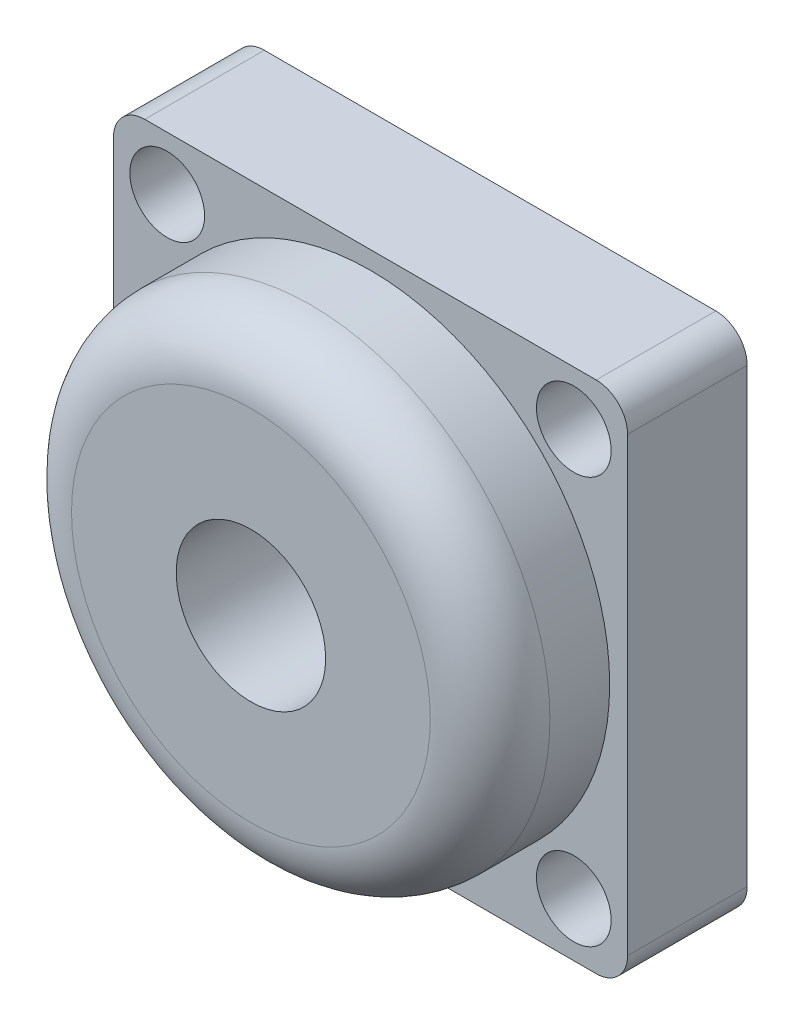
ISO-10303-21;
HEADER;
FILE_DESCRIPTION(('STEP AP214'),'2;1');
FILE_NAME('part.step','',(''),(''),'','','');
FILE_SCHEMA(('AUTOMOTIVE_DESIGN { 1 0 10303 214 1 1 1 1 }'));
ENDSEC;
DATA;
#1=APPLICATION_CONTEXT('core data for automotive mechanical design processes');
#2=APPLICATION_PROTOCOL_DEFINITION('international standard','automotive_design',2000,#1);
#3=PRODUCT_CONTEXT('',#1,'mechanical');
#4=PRODUCT('Part','Part','',(#3));
#5=PRODUCT_RELATED_PRODUCT_CATEGORY('part','',(#4));
#6=PRODUCT_DEFINITION_FORMATION('','',#4);
#7=PRODUCT_DEFINITION_CONTEXT('part definition',#1,'design');
#8=PRODUCT_DEFINITION('design','',#6,#7);
#9=PRODUCT_DEFINITION_SHAPE('','',#8);
#10=(LENGTH_UNIT() NAMED_UNIT(*) SI_UNIT(.MILLI.,.METRE.));
#11=(NAMED_UNIT(*) PLANE_ANGLE_UNIT() SI_UNIT($,.RADIAN.));
#12=(NAMED_UNIT(*) SI_UNIT($,.STERADIAN.) SOLID_ANGLE_UNIT());
#13=UNCERTAINTY_MEASURE_WITH_UNIT(LENGTH_MEASURE(1.E-05),#10,'distance_accuracy_value','');
#14=(GEOMETRIC_REPRESENTATION_CONTEXT(3) GLOBAL_UNCERTAINTY_ASSIGNED_CONTEXT((#13)) GLOBAL_UNIT_ASSIGNED_CONTEXT((#10,
#11,#12)) REPRESENTATION_CONTEXT('',''));
#15=CARTESIAN_POINT('',(0.,0.,0.));
#16=DIRECTION('',(0.,0.,1.));
#17=DIRECTION('',(1.,0.,0.));
#18=AXIS2_PLACEMENT_3D('',#15,#16,#17);
#19=CARTESIAN_POINT('',(37.75,37.75,20.));
#20=DIRECTION('',(0.,0.,-1.));
#21=DIRECTION('',(-1.,0.,0.));
#22=AXIS2_PLACEMENT_3D('',#19,#20,#21);
#23=CYLINDRICAL_SURFACE('',#22,5.24999999999999);
#24=CARTESIAN_POINT('',(37.75,37.75,0.));
#25=DIRECTION('',(0.,0.,1.));
#26=DIRECTION('',(1.,0.,0.));
#27=AXIS2_PLACEMENT_3D('',#24,#25,#26);
#28=CIRCLE('',#27,5.24999999999999);
#29=CARTESIAN_POINT('',(43.,37.75,0.));
#30=VERTEX_POINT('',#29);
#31=CARTESIAN_POINT('',(37.75,43.,0.));
#32=VERTEX_POINT('',#31);
#33=EDGE_CURVE('E135',#30,#32,#28,.T.);
#34=ORIENTED_EDGE('',*,*,#33,.T.);
#35=DIRECTION('',(0.,0.,-1.));
#36=VECTOR('',#35,1.);
#37=CARTESIAN_POINT('',(37.75,43.,20.));
#38=LINE('',#37,#36);
#39=CARTESIAN_POINT('',(37.75,43.,20.));
#40=VERTEX_POINT('',#39);
#41=EDGE_CURVE('E163',#40,#32,#38,.T.);
#42=ORIENTED_EDGE('',*,*,#41,.F.);
#43=CARTESIAN_POINT('',(37.75,37.75,20.));
#44=DIRECTION('',(0.,0.,1.));
#45=DIRECTION('',(1.,0.,0.));
#46=AXIS2_PLACEMENT_3D('',#43,#44,#45);
#47=CIRCLE('',#46,5.24999999999999);
#48=CARTESIAN_POINT('',(43.,37.75,20.));
#49=VERTEX_POINT('',#48);
#50=EDGE_CURVE('E150',#49,#40,#47,.T.);
#51=ORIENTED_EDGE('',*,*,#50,.F.);
#52=DIRECTION('',(0.,0.,-1.));
#53=VECTOR('',#52,1.);
#54=CARTESIAN_POINT('',(43.,37.75,20.));
#55=LINE('',#54,#53);
#56=EDGE_CURVE('E131',#49,#30,#55,.T.);
#57=ORIENTED_EDGE('',*,*,#56,.T.);
#58=EDGE_LOOP('',(#34,#42,#51,#57));
#59=FACE_BOUND('',#58,.T.);
#60=ADVANCED_FACE('F37',(#59),#23,.T.);
#61=CARTESIAN_POINT('',(37.75,43.,20.));
#62=DIRECTION('',(0.,-1.,0.));
#63=DIRECTION('',(1.,0.,0.));
#64=AXIS2_PLACEMENT_3D('',#61,#62,#63);
#65=PLANE('',#64);
#66=DIRECTION('',(-1.,0.,0.));
#67=VECTOR('',#66,1.);
#68=CARTESIAN_POINT('',(37.75,43.,0.));
#69=LINE('',#68,#67);
#70=CARTESIAN_POINT('',(-37.75,43.,0.));
#71=VERTEX_POINT('',#70);
#72=EDGE_CURVE('E138',#32,#71,#69,.T.);
#73=ORIENTED_EDGE('',*,*,#72,.T.);
#74=DIRECTION('',(0.,0.,-1.));
#75=VECTOR('',#74,1.);
#76=CARTESIAN_POINT('',(-37.75,43.,20.));
#77=LINE('',#76,#75);
#78=CARTESIAN_POINT('',(-37.75,43.,20.));
#79=VERTEX_POINT('',#78);
#80=EDGE_CURVE('E160',#79,#71,#77,.T.);
#81=ORIENTED_EDGE('',*,*,#80,.F.);
#82=DIRECTION('',(-1.,0.,0.));
#83=VECTOR('',#82,1.);
#84=CARTESIAN_POINT('',(37.75,43.,20.));
#85=LINE('',#84,#83);
#86=EDGE_CURVE('E98',#40,#79,#85,.T.);
#87=ORIENTED_EDGE('',*,*,#86,.F.);
#88=ORIENTED_EDGE('',*,*,#41,.T.);
#89=EDGE_LOOP('',(#73,#81,#87,#88));
#90=FACE_BOUND('',#89,.T.);
#91=ADVANCED_FACE('F181',(#90),#65,.F.);
#92=CARTESIAN_POINT('',(-37.75,37.75,20.));
#93=DIRECTION('',(0.,0.,-1.));
#94=DIRECTION('',(-1.,0.,0.));
#95=AXIS2_PLACEMENT_3D('',#92,#93,#94);
#96=CYLINDRICAL_SURFACE('',#95,5.24999999999999);
#97=CARTESIAN_POINT('',(-37.75,37.75,0.));
#98=DIRECTION('',(0.,0.,1.));
#99=DIRECTION('',(1.,0.,0.));
#100=AXIS2_PLACEMENT_3D('',#97,#98,#99);
#101=CIRCLE('',#100,5.24999999999999);
#102=CARTESIAN_POINT('',(-43.,37.75,0.));
#103=VERTEX_POINT('',#102);
#104=EDGE_CURVE('E141',#71,#103,#101,.T.);
#105=ORIENTED_EDGE('',*,*,#104,.T.);
#106=DIRECTION('',(0.,0.,-1.));
#107=VECTOR('',#106,1.);
#108=CARTESIAN_POINT('',(-43.,37.75,20.));
#109=LINE('',#108,#107);
#110=CARTESIAN_POINT('',(-43.,37.75,20.));
#111=VERTEX_POINT('',#110);
#112=EDGE_CURVE('E157',#111,#103,#109,.T.);
#113=ORIENTED_EDGE('',*,*,#112,.F.);
#114=CARTESIAN_POINT('',(-37.75,37.75,20.));
#115=DIRECTION('',(0.,0.,1.));
#116=DIRECTION('',(1.,0.,0.));
#117=AXIS2_PLACEMENT_3D('',#114,#115,#116);
#118=CIRCLE('',#117,5.24999999999999);
#119=EDGE_CURVE('E274',#79,#111,#118,.T.);
#120=ORIENTED_EDGE('',*,*,#119,.F.);
#121=ORIENTED_EDGE('',*,*,#80,.T.);
#122=EDGE_LOOP('',(#105,#113,#120,#121));
#123=FACE_BOUND('',#122,.T.);
#124=ADVANCED_FACE('F186',(#123),#96,.T.);
#125=CARTESIAN_POINT('',(-43.,-37.75,20.));
#126=DIRECTION('',(1.,0.,0.));
#127=DIRECTION('',(0.,0.,-1.));
#128=AXIS2_PLACEMENT_3D('',#125,#126,#127);
#129=PLANE('',#128);
#130=DIRECTION('',(0.,-1.,0.));
#131=VECTOR('',#130,1.);
#132=CARTESIAN_POINT('',(-43.,-37.75,0.));
#133=LINE('',#132,#131);
#134=CARTESIAN_POINT('',(-43.,-37.75,0.));
#135=VERTEX_POINT('',#134);
#136=EDGE_CURVE('E143',#103,#135,#133,.T.);
#137=ORIENTED_EDGE('',*,*,#136,.T.);
#138=DIRECTION('',(0.,0.,-1.));
#139=VECTOR('',#138,1.);
#140=CARTESIAN_POINT('',(-43.,-37.75,20.));
#141=LINE('',#140,#139);
#142=CARTESIAN_POINT('',(-43.,-37.75,20.));
#143=VERTEX_POINT('',#142);
#144=EDGE_CURVE('E154',#143,#135,#141,.T.);
#145=ORIENTED_EDGE('',*,*,#144,.F.);
#146=DIRECTION('',(0.,-1.,0.));
#147=VECTOR('',#146,1.);
#148=CARTESIAN_POINT('',(-43.,-37.75,20.));
#149=LINE('',#148,#147);
#150=EDGE_CURVE('E276',#111,#143,#149,.T.);
#151=ORIENTED_EDGE('',*,*,#150,.F.);
#152=ORIENTED_EDGE('',*,*,#112,.T.);
#153=EDGE_LOOP('',(#137,#145,#151,#152));
#154=FACE_BOUND('',#153,.T.);
#155=ADVANCED_FACE('F191',(#154),#129,.F.);
#156=CARTESIAN_POINT('',(-37.75,-37.75,20.));
#157=DIRECTION('',(0.,0.,-1.));
#158=DIRECTION('',(-1.,0.,0.));
#159=AXIS2_PLACEMENT_3D('',#156,#157,#158);
#160=CYLINDRICAL_SURFACE('',#159,5.24999999999999);
#161=CARTESIAN_POINT('',(-37.75,-37.75,0.));
#162=DIRECTION('',(0.,0.,1.));
#163=DIRECTION('',(-1.,0.,0.));
#164=AXIS2_PLACEMENT_3D('',#161,#162,#163);
#165=CIRCLE('',#164,5.24999999999999);
#166=CARTESIAN_POINT('',(-37.75,-43.,0.));
#167=VERTEX_POINT('',#166);
#168=EDGE_CURVE('E145',#135,#167,#165,.T.);
#169=ORIENTED_EDGE('',*,*,#168,.T.);
#170=DIRECTION('',(0.,0.,-1.));
#171=VECTOR('',#170,1.);
#172=CARTESIAN_POINT('',(-37.75,-43.,20.));
#173=LINE('',#172,#171);
#174=CARTESIAN_POINT('',(-37.75,-43.,20.));
#175=VERTEX_POINT('',#174);
#176=EDGE_CURVE('E126',#175,#167,#173,.T.);
#177=ORIENTED_EDGE('',*,*,#176,.F.);
#178=CARTESIAN_POINT('',(-37.75,-37.75,20.));
#179=DIRECTION('',(0.,0.,1.));
#180=DIRECTION('',(-1.,0.,0.));
#181=AXIS2_PLACEMENT_3D('',#178,#179,#180);
#182=CIRCLE('',#181,5.24999999999999);
#183=EDGE_CURVE('E117',#143,#175,#182,.T.);
#184=ORIENTED_EDGE('',*,*,#183,.F.);
#185=ORIENTED_EDGE('',*,*,#144,.T.);
#186=EDGE_LOOP('',(#169,#177,#184,#185));
#187=FACE_BOUND('',#186,.T.);
#188=ADVANCED_FACE('F195',(#187),#160,.T.);
#189=CARTESIAN_POINT('',(37.75,-43.,20.));
#190=DIRECTION('',(0.,1.,0.));
#191=DIRECTION('',(0.,0.,1.));
#192=AXIS2_PLACEMENT_3D('',#189,#190,#191);
#193=PLANE('',#192);
#194=DIRECTION('',(1.,0.,0.));
#195=VECTOR('',#194,1.);
#196=CARTESIAN_POINT('',(37.75,-43.,0.));
#197=LINE('',#196,#195);
#198=CARTESIAN_POINT('',(37.75,-43.,0.));
#199=VERTEX_POINT('',#198);
#200=EDGE_CURVE('E125',#167,#199,#197,.T.);
#201=ORIENTED_EDGE('',*,*,#200,.T.);
#202=DIRECTION('',(0.,0.,-1.));
#203=VECTOR('',#202,1.);
#204=CARTESIAN_POINT('',(37.75,-43.,20.));
#205=LINE('',#204,#203);
#206=CARTESIAN_POINT('',(37.75,-43.,20.));
#207=VERTEX_POINT('',#206);
#208=EDGE_CURVE('E122',#207,#199,#205,.T.);
#209=ORIENTED_EDGE('',*,*,#208,.F.);
#210=DIRECTION('',(1.,0.,0.));
#211=VECTOR('',#210,1.);
#212=CARTESIAN_POINT('',(37.75,-43.,20.));
#213=LINE('',#212,#211);
#214=EDGE_CURVE('E111',#175,#207,#213,.T.);
#215=ORIENTED_EDGE('',*,*,#214,.F.);
#216=ORIENTED_EDGE('',*,*,#176,.T.);
#217=EDGE_LOOP('',(#201,#209,#215,#216));
#218=FACE_BOUND('',#217,.T.);
#219=ADVANCED_FACE('F123',(#218),#193,.F.);
#220=CARTESIAN_POINT('',(37.75,-37.75,20.));
#221=DIRECTION('',(0.,0.,-1.));
#222=DIRECTION('',(-1.,0.,0.));
#223=AXIS2_PLACEMENT_3D('',#220,#221,#222);
#224=CYLINDRICAL_SURFACE('',#223,5.25);
#225=CARTESIAN_POINT('',(37.75,-37.75,0.));
#226=DIRECTION('',(0.,0.,1.));
#227=DIRECTION('',(1.,0.,0.));
#228=AXIS2_PLACEMENT_3D('',#225,#226,#227);
#229=CIRCLE('',#228,5.25);
#230=CARTESIAN_POINT('',(43.,-37.75,0.));
#231=VERTEX_POINT('',#230);
#232=EDGE_CURVE('E83',#199,#231,#229,.T.);
#233=ORIENTED_EDGE('',*,*,#232,.T.);
#234=DIRECTION('',(0.,0.,-1.));
#235=VECTOR('',#234,1.);
#236=CARTESIAN_POINT('',(43.,-37.75,20.));
#237=LINE('',#236,#235);
#238=CARTESIAN_POINT('',(43.,-37.75,20.));
#239=VERTEX_POINT('',#238);
#240=EDGE_CURVE('E127',#239,#231,#237,.T.);
#241=ORIENTED_EDGE('',*,*,#240,.F.);
#242=CARTESIAN_POINT('',(37.75,-37.75,20.));
#243=DIRECTION('',(0.,0.,1.));
#244=DIRECTION('',(1.,0.,0.));
#245=AXIS2_PLACEMENT_3D('',#242,#243,#244);
#246=CIRCLE('',#245,5.25);
#247=EDGE_CURVE('E115',#207,#239,#246,.T.);
#248=ORIENTED_EDGE('',*,*,#247,.F.);
#249=ORIENTED_EDGE('',*,*,#208,.T.);
#250=EDGE_LOOP('',(#233,#241,#248,#249));
#251=FACE_BOUND('',#250,.T.);
#252=ADVANCED_FACE('F129',(#251),#224,.T.);
#253=CARTESIAN_POINT('',(43.,-37.75,20.));
#254=DIRECTION('',(-1.,0.,0.));
#255=DIRECTION('',(0.,-1.,0.));
#256=AXIS2_PLACEMENT_3D('',#253,#254,#255);
#257=PLANE('',#256);
#258=DIRECTION('',(0.,1.,0.));
#259=VECTOR('',#258,1.);
#260=CARTESIAN_POINT('',(43.,-37.75,0.));
#261=LINE('',#260,#259);
#262=EDGE_CURVE('E89',#231,#30,#261,.T.);
#263=ORIENTED_EDGE('',*,*,#262,.T.);
#264=ORIENTED_EDGE('',*,*,#56,.F.);
#265=DIRECTION('',(0.,1.,0.));
#266=VECTOR('',#265,1.);
#267=CARTESIAN_POINT('',(43.,-37.75,20.));
#268=LINE('',#267,#266);
#269=EDGE_CURVE('E54',#239,#49,#268,.T.);
#270=ORIENTED_EDGE('',*,*,#269,.F.);
#271=ORIENTED_EDGE('',*,*,#240,.T.);
#272=EDGE_LOOP('',(#263,#264,#270,#271));
#273=FACE_BOUND('',#272,.T.);
#274=ADVANCED_FACE('F204',(#273),#257,.F.);
#275=CARTESIAN_POINT('',(37.75,37.75,20.));
#276=DIRECTION('',(0.,0.,1.));
#277=DIRECTION('',(1.,0.,0.));
#278=AXIS2_PLACEMENT_3D('',#275,#276,#277);
#279=PLANE('',#278);
#280=CARTESIAN_POINT('',(-34.,-34.,20.));
#281=DIRECTION('',(0.,0.,1.));
#282=DIRECTION('',(1.,0.,0.));
#283=AXIS2_PLACEMENT_3D('',#280,#281,#282);
#284=CIRCLE('',#283,6.25);
#285=CARTESIAN_POINT('',(-27.75,-34.,20.));
#286=VERTEX_POINT('',#285);
#287=EDGE_CURVE('E244',#286,#286,#284,.T.);
#288=ORIENTED_EDGE('',*,*,#287,.F.);
#289=EDGE_LOOP('',(#288));
#290=FACE_BOUND('',#289,.T.);
#291=CARTESIAN_POINT('',(34.,-34.,20.));
#292=DIRECTION('',(0.,0.,1.));
#293=DIRECTION('',(1.,0.,0.));
#294=AXIS2_PLACEMENT_3D('',#291,#292,#293);
#295=CIRCLE('',#294,6.25);
#296=CARTESIAN_POINT('',(40.25,-34.,20.));
#297=VERTEX_POINT('',#296);
#298=EDGE_CURVE('E239',#297,#297,#295,.T.);
#299=ORIENTED_EDGE('',*,*,#298,.F.);
#300=EDGE_LOOP('',(#299));
#301=FACE_BOUND('',#300,.T.);
#302=CARTESIAN_POINT('',(34.,34.,20.));
#303=DIRECTION('',(0.,0.,1.));
#304=DIRECTION('',(1.,0.,0.));
#305=AXIS2_PLACEMENT_3D('',#302,#303,#304);
#306=CIRCLE('',#305,6.25);
#307=CARTESIAN_POINT('',(40.25,34.,20.));
#308=VERTEX_POINT('',#307);
#309=EDGE_CURVE('E255',#308,#308,#306,.T.);
#310=ORIENTED_EDGE('',*,*,#309,.F.);
#311=EDGE_LOOP('',(#310));
#312=FACE_BOUND('',#311,.T.);
#313=CARTESIAN_POINT('',(-34.,34.,20.));
#314=DIRECTION('',(0.,0.,1.));
#315=DIRECTION('',(1.,0.,0.));
#316=AXIS2_PLACEMENT_3D('',#313,#314,#315);
#317=CIRCLE('',#316,6.25);
#318=CARTESIAN_POINT('',(-27.75,34.,20.));
#319=VERTEX_POINT('',#318);
#320=EDGE_CURVE('E261',#319,#319,#317,.T.);
#321=ORIENTED_EDGE('',*,*,#320,.F.);
#322=EDGE_LOOP('',(#321));
#323=FACE_BOUND('',#322,.T.);
#324=CARTESIAN_POINT('',(0.,0.,20.));
#325=DIRECTION('',(0.,0.,1.));
#326=DIRECTION('',(1.,0.,0.));
#327=AXIS2_PLACEMENT_3D('',#324,#325,#326);
#328=CIRCLE('',#327,40.);
#329=CARTESIAN_POINT('',(40.,0.,20.));
#330=VERTEX_POINT('',#329);
#331=EDGE_CURVE('E139',#330,#330,#328,.T.);
#332=ORIENTED_EDGE('',*,*,#331,.F.);
#333=EDGE_LOOP('',(#332));
#334=FACE_BOUND('',#333,.T.);
#335=ORIENTED_EDGE('',*,*,#50,.T.);
#336=ORIENTED_EDGE('',*,*,#86,.T.);
#337=ORIENTED_EDGE('',*,*,#119,.T.);
#338=ORIENTED_EDGE('',*,*,#150,.T.);
#339=ORIENTED_EDGE('',*,*,#183,.T.);
#340=ORIENTED_EDGE('',*,*,#214,.T.);
#341=ORIENTED_EDGE('',*,*,#247,.T.);
#342=ORIENTED_EDGE('',*,*,#269,.T.);
#343=EDGE_LOOP('',(#335,#336,#337,#338,#339,#340,#341,#342));
#344=FACE_BOUND('',#343,.T.);
#345=ADVANCED_FACE('F113',(#290,#301,#312,#323,#334,#344),#279,.T.);
#346=CARTESIAN_POINT('',(37.75,37.75,0.));
#347=DIRECTION('',(0.,0.,1.));
#348=DIRECTION('',(1.,0.,0.));
#349=AXIS2_PLACEMENT_3D('',#346,#347,#348);
#350=PLANE('',#349);
#351=CARTESIAN_POINT('',(-34.,-34.,0.));
#352=DIRECTION('',(0.,0.,1.));
#353=DIRECTION('',(1.,0.,0.));
#354=AXIS2_PLACEMENT_3D('',#351,#352,#353);
#355=CIRCLE('',#354,6.25);
#356=CARTESIAN_POINT('',(-27.75,-34.,0.));
#357=VERTEX_POINT('',#356);
#358=EDGE_CURVE('E249',#357,#357,#355,.T.);
#359=ORIENTED_EDGE('',*,*,#358,.T.);
#360=EDGE_LOOP('',(#359));
#361=FACE_BOUND('',#360,.T.);
#362=CARTESIAN_POINT('',(34.,-34.,0.));
#363=DIRECTION('',(0.,0.,1.));
#364=DIRECTION('',(1.,0.,0.));
#365=AXIS2_PLACEMENT_3D('',#362,#363,#364);
#366=CIRCLE('',#365,6.25);
#367=CARTESIAN_POINT('',(40.25,-34.,0.));
#368=VERTEX_POINT('',#367);
#369=EDGE_CURVE('E242',#368,#368,#366,.T.);
#370=ORIENTED_EDGE('',*,*,#369,.T.);
#371=EDGE_LOOP('',(#370));
#372=FACE_BOUND('',#371,.T.);
#373=CARTESIAN_POINT('',(34.,34.,0.));
#374=DIRECTION('',(0.,0.,1.));
#375=DIRECTION('',(1.,0.,0.));
#376=AXIS2_PLACEMENT_3D('',#373,#374,#375);
#377=CIRCLE('',#376,6.25);
#378=CARTESIAN_POINT('',(40.25,34.,0.));
#379=VERTEX_POINT('',#378);
#380=EDGE_CURVE('E246',#379,#379,#377,.T.);
#381=ORIENTED_EDGE('',*,*,#380,.T.);
#382=EDGE_LOOP('',(#381));
#383=FACE_BOUND('',#382,.T.);
#384=CARTESIAN_POINT('',(-34.,34.,0.));
#385=DIRECTION('',(0.,0.,1.));
#386=DIRECTION('',(1.,0.,0.));
#387=AXIS2_PLACEMENT_3D('',#384,#385,#386);
#388=CIRCLE('',#387,6.25);
#389=CARTESIAN_POINT('',(-27.75,34.,0.));
#390=VERTEX_POINT('',#389);
#391=EDGE_CURVE('E258',#390,#390,#388,.T.);
#392=ORIENTED_EDGE('',*,*,#391,.T.);
#393=EDGE_LOOP('',(#392));
#394=FACE_BOUND('',#393,.T.);
#395=CARTESIAN_POINT('',(0.,0.,0.));
#396=DIRECTION('',(0.,0.,1.));
#397=DIRECTION('',(1.,0.,0.));
#398=AXIS2_PLACEMENT_3D('',#395,#396,#397);
#399=CIRCLE('',#398,12.5);
#400=CARTESIAN_POINT('',(12.5,0.,0.));
#401=VERTEX_POINT('',#400);
#402=EDGE_CURVE('E265',#401,#401,#399,.T.);
#403=ORIENTED_EDGE('',*,*,#402,.T.);
#404=EDGE_LOOP('',(#403));
#405=FACE_BOUND('',#404,.T.);
#406=ORIENTED_EDGE('',*,*,#33,.F.);
#407=ORIENTED_EDGE('',*,*,#262,.F.);
#408=ORIENTED_EDGE('',*,*,#232,.F.);
#409=ORIENTED_EDGE('',*,*,#200,.F.);
#410=ORIENTED_EDGE('',*,*,#168,.F.);
#411=ORIENTED_EDGE('',*,*,#136,.F.);
#412=ORIENTED_EDGE('',*,*,#104,.F.);
#413=ORIENTED_EDGE('',*,*,#72,.F.);
#414=EDGE_LOOP('',(#406,#407,#408,#409,#410,#411,#412,#413));
#415=FACE_BOUND('',#414,.T.);
#416=ADVANCED_FACE('F207',(#361,#372,#383,#394,#405,#415),#350,.F.);
#417=CARTESIAN_POINT('',(0.,0.,40.));
#418=DIRECTION('',(0.,0.,-1.));
#419=DIRECTION('',(-1.,0.,0.));
#420=AXIS2_PLACEMENT_3D('',#417,#418,#419);
#421=CYLINDRICAL_SURFACE('',#420,40.);
#422=CARTESIAN_POINT('',(0.,0.,30.));
#423=DIRECTION('',(0.,0.,1.));
#424=DIRECTION('',(1.,0.,0.));
#425=AXIS2_PLACEMENT_3D('',#422,#423,#424);
#426=CIRCLE('',#425,40.);
#427=CARTESIAN_POINT('',(40.,0.,30.));
#428=VERTEX_POINT('',#427);
#429=EDGE_CURVE('E11',#428,#428,#426,.F.);
#430=ORIENTED_EDGE('',*,*,#429,.T.);
#431=EDGE_LOOP('',(#430));
#432=FACE_BOUND('',#431,.T.);
#433=ORIENTED_EDGE('',*,*,#331,.T.);
#434=EDGE_LOOP('',(#433));
#435=FACE_BOUND('',#434,.T.);
#436=ADVANCED_FACE('F210',(#432,#435),#421,.T.);
#437=CARTESIAN_POINT('',(0.,0.,40.));
#438=DIRECTION('',(0.,0.,1.));
#439=DIRECTION('',(1.,0.,0.));
#440=AXIS2_PLACEMENT_3D('',#437,#438,#439);
#441=PLANE('',#440);
#442=CARTESIAN_POINT('',(0.,0.,40.));
#443=DIRECTION('',(0.,0.,1.));
#444=DIRECTION('',(1.,0.,0.));
#445=AXIS2_PLACEMENT_3D('',#442,#443,#444);
#446=CIRCLE('',#445,30.);
#447=CARTESIAN_POINT('',(30.,0.,40.));
#448=VERTEX_POINT('',#447);
#449=EDGE_CURVE('E46',#448,#448,#446,.T.);
#450=ORIENTED_EDGE('',*,*,#449,.T.);
#451=EDGE_LOOP('',(#450));
#452=FACE_BOUND('',#451,.T.);
#453=CARTESIAN_POINT('',(0.,0.,40.));
#454=DIRECTION('',(0.,0.,1.));
#455=DIRECTION('',(1.,0.,0.));
#456=AXIS2_PLACEMENT_3D('',#453,#454,#455);
#457=CIRCLE('',#456,12.5);
#458=CARTESIAN_POINT('',(12.5,0.,40.));
#459=VERTEX_POINT('',#458);
#460=EDGE_CURVE('E264',#459,#459,#457,.T.);
#461=ORIENTED_EDGE('',*,*,#460,.F.);
#462=EDGE_LOOP('',(#461));
#463=FACE_BOUND('',#462,.T.);
#464=ADVANCED_FACE('F167',(#452,#463),#441,.T.);
#465=CARTESIAN_POINT('',(0.,0.,0.));
#466=DIRECTION('',(0.,0.,1.));
#467=DIRECTION('',(1.,0.,0.));
#468=AXIS2_PLACEMENT_3D('',#465,#466,#467);
#469=CYLINDRICAL_SURFACE('',#468,12.5);
#470=ORIENTED_EDGE('',*,*,#402,.F.);
#471=EDGE_LOOP('',(#470));
#472=FACE_BOUND('',#471,.T.);
#473=ORIENTED_EDGE('',*,*,#460,.T.);
#474=EDGE_LOOP('',(#473));
#475=FACE_BOUND('',#474,.T.);
#476=ADVANCED_FACE('F220',(#472,#475),#469,.F.);
#477=CARTESIAN_POINT('',(-34.,34.,0.));
#478=DIRECTION('',(0.,0.,1.));
#479=DIRECTION('',(1.,0.,0.));
#480=AXIS2_PLACEMENT_3D('',#477,#478,#479);
#481=CYLINDRICAL_SURFACE('',#480,6.25);
#482=ORIENTED_EDGE('',*,*,#320,.T.);
#483=EDGE_LOOP('',(#482));
#484=FACE_BOUND('',#483,.T.);
#485=ORIENTED_EDGE('',*,*,#391,.F.);
#486=EDGE_LOOP('',(#485));
#487=FACE_BOUND('',#486,.T.);
#488=ADVANCED_FACE('F223',(#484,#487),#481,.F.);
#489=CARTESIAN_POINT('',(34.,34.,0.));
#490=DIRECTION('',(0.,0.,1.));
#491=DIRECTION('',(1.,0.,0.));
#492=AXIS2_PLACEMENT_3D('',#489,#490,#491);
#493=CYLINDRICAL_SURFACE('',#492,6.25);
#494=ORIENTED_EDGE('',*,*,#309,.T.);
#495=EDGE_LOOP('',(#494));
#496=FACE_BOUND('',#495,.T.);
#497=ORIENTED_EDGE('',*,*,#380,.F.);
#498=EDGE_LOOP('',(#497));
#499=FACE_BOUND('',#498,.T.);
#500=ADVANCED_FACE('F227',(#496,#499),#493,.F.);
#501=CARTESIAN_POINT('',(34.,-34.,0.));
#502=DIRECTION('',(0.,0.,1.));
#503=DIRECTION('',(1.,0.,0.));
#504=AXIS2_PLACEMENT_3D('',#501,#502,#503);
#505=CYLINDRICAL_SURFACE('',#504,6.25);
#506=ORIENTED_EDGE('',*,*,#298,.T.);
#507=EDGE_LOOP('',(#506));
#508=FACE_BOUND('',#507,.T.);
#509=ORIENTED_EDGE('',*,*,#369,.F.);
#510=EDGE_LOOP('',(#509));
#511=FACE_BOUND('',#510,.T.);
#512=ADVANCED_FACE('F176',(#508,#511),#505,.F.);
#513=CARTESIAN_POINT('',(-34.,-34.,0.));
#514=DIRECTION('',(0.,0.,1.));
#515=DIRECTION('',(1.,0.,0.));
#516=AXIS2_PLACEMENT_3D('',#513,#514,#515);
#517=CYLINDRICAL_SURFACE('',#516,6.25);
#518=ORIENTED_EDGE('',*,*,#287,.T.);
#519=EDGE_LOOP('',(#518));
#520=FACE_BOUND('',#519,.T.);
#521=ORIENTED_EDGE('',*,*,#358,.F.);
#522=EDGE_LOOP('',(#521));
#523=FACE_BOUND('',#522,.T.);
#524=ADVANCED_FACE('F171',(#520,#523),#517,.F.);
#525=CARTESIAN_POINT('',(0.,0.,30.));
#526=DIRECTION('',(0.,0.,1.));
#527=DIRECTION('',(1.,0.,0.));
#528=AXIS2_PLACEMENT_3D('',#525,#526,#527);
#529=TOROIDAL_SURFACE('',#528,30.,10.);
#530=ORIENTED_EDGE('',*,*,#429,.F.);
#531=EDGE_LOOP('',(#530));
#532=FACE_BOUND('',#531,.T.);
#533=ORIENTED_EDGE('',*,*,#449,.F.);
#534=EDGE_LOOP('',(#533));
#535=FACE_BOUND('',#534,.T.);
#536=ADVANCED_FACE('F39',(#532,#535),#529,.T.);
#537=CLOSED_SHELL('',(#60,#91,#124,#155,#188,#219,#252,#274,#345,#416,#436,#464,#476,#488,#500,
#512,#524,#536));
#538=MANIFOLD_SOLID_BREP('B2',#537);
#539=ADVANCED_BREP_SHAPE_REPRESENTATION('',(#18,#538),#14);
#540=SHAPE_DEFINITION_REPRESENTATION(#9,#539);
ENDSEC;
END-ISO-10303-21;
